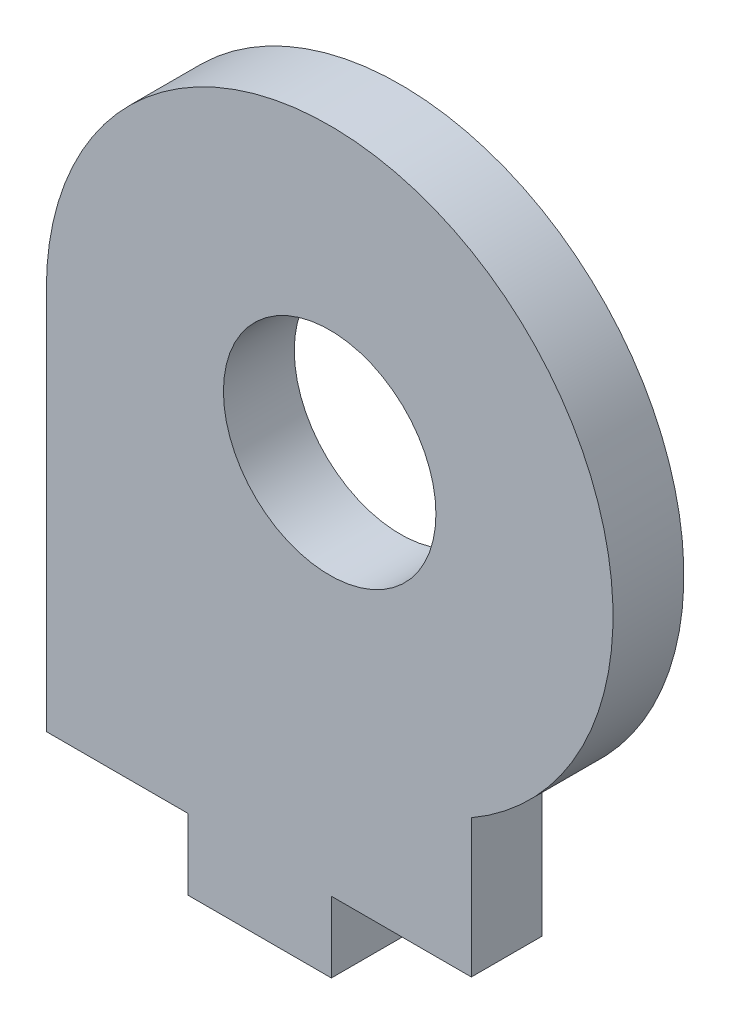
ISO-10303-21;
HEADER;
FILE_DESCRIPTION(('STEP AP214'),'2;1');
FILE_NAME('part.step','',(''),(''),'','','');
FILE_SCHEMA(('AUTOMOTIVE_DESIGN { 1 0 10303 214 1 1 1 1 }'));
ENDSEC;
DATA;
#1=APPLICATION_CONTEXT('core data for automotive mechanical design processes');
#2=APPLICATION_PROTOCOL_DEFINITION('international standard','automotive_design',2000,#1);
#3=PRODUCT_CONTEXT('',#1,'mechanical');
#4=PRODUCT('Part','Part','',(#3));
#5=PRODUCT_RELATED_PRODUCT_CATEGORY('part','',(#4));
#6=PRODUCT_DEFINITION_FORMATION('','',#4);
#7=PRODUCT_DEFINITION_CONTEXT('part definition',#1,'design');
#8=PRODUCT_DEFINITION('design','',#6,#7);
#9=PRODUCT_DEFINITION_SHAPE('','',#8);
#10=(LENGTH_UNIT() NAMED_UNIT(*) SI_UNIT(.MILLI.,.METRE.));
#11=(NAMED_UNIT(*) PLANE_ANGLE_UNIT() SI_UNIT($,.RADIAN.));
#12=(NAMED_UNIT(*) SI_UNIT($,.STERADIAN.) SOLID_ANGLE_UNIT());
#13=UNCERTAINTY_MEASURE_WITH_UNIT(LENGTH_MEASURE(1.E-05),#10,'distance_accuracy_value','');
#14=(GEOMETRIC_REPRESENTATION_CONTEXT(3) GLOBAL_UNCERTAINTY_ASSIGNED_CONTEXT((#13)) GLOBAL_UNIT_ASSIGNED_CONTEXT((#10,
#11,#12)) REPRESENTATION_CONTEXT('',''));
#15=CARTESIAN_POINT('',(0.,0.,0.));
#16=DIRECTION('',(0.,0.,1.));
#17=DIRECTION('',(1.,0.,0.));
#18=AXIS2_PLACEMENT_3D('',#15,#16,#17);
#19=CARTESIAN_POINT('',(27.0376756424581,0.,3.175));
#20=DIRECTION('',(-1.,0.,0.));
#21=DIRECTION('',(0.,0.,1.));
#22=AXIS2_PLACEMENT_3D('',#19,#20,#21);
#23=PLANE('',#22);
#24=DIRECTION('',(0.,0.,1.));
#25=VECTOR('',#24,1.);
#26=CARTESIAN_POINT('',(27.0376756424581,3.175,0.));
#27=LINE('',#26,#25);
#28=CARTESIAN_POINT('',(27.0376756424581,3.175,0.));
#29=VERTEX_POINT('',#28);
#30=CARTESIAN_POINT('',(27.0376756424581,3.175,3.175));
#31=VERTEX_POINT('',#30);
#32=EDGE_CURVE('E177',#29,#31,#27,.T.);
#33=ORIENTED_EDGE('',*,*,#32,.F.);
#34=DIRECTION('',(0.,1.,0.));
#35=VECTOR('',#34,1.);
#36=CARTESIAN_POINT('',(27.0376756424581,0.,0.));
#37=LINE('',#36,#35);
#38=CARTESIAN_POINT('',(27.0376756424581,9.35830737193762,0.));
#39=VERTEX_POINT('',#38);
#40=EDGE_CURVE('E144',#29,#39,#37,.T.);
#41=ORIENTED_EDGE('',*,*,#40,.T.);
#42=DIRECTION('',(0.,0.,-1.));
#43=VECTOR('',#42,1.);
#44=CARTESIAN_POINT('',(27.0376756424581,9.35830737193762,3.175));
#45=LINE('',#44,#43);
#46=CARTESIAN_POINT('',(27.0376756424581,9.35830737193762,3.175));
#47=VERTEX_POINT('',#46);
#48=EDGE_CURVE('E11',#47,#39,#45,.T.);
#49=ORIENTED_EDGE('',*,*,#48,.F.);
#50=DIRECTION('',(0.,1.,0.));
#51=VECTOR('',#50,1.);
#52=CARTESIAN_POINT('',(27.0376756424581,0.,3.175));
#53=LINE('',#52,#51);
#54=EDGE_CURVE('E142',#31,#47,#53,.T.);
#55=ORIENTED_EDGE('',*,*,#54,.F.);
#56=EDGE_LOOP('',(#33,#41,#49,#55));
#57=FACE_BOUND('',#56,.T.);
#58=ADVANCED_FACE('F43',(#57),#23,.F.);
#59=CARTESIAN_POINT('',(20.6876756424581,20.35683,3.175));
#60=DIRECTION('',(0.,0.,1.));
#61=DIRECTION('',(1.,0.,0.));
#62=AXIS2_PLACEMENT_3D('',#59,#60,#61);
#63=PLANE('',#62);
#64=DIRECTION('',(0.,-1.,0.));
#65=VECTOR('',#64,1.);
#66=CARTESIAN_POINT('',(14.3376756424581,3.175,3.175));
#67=LINE('',#66,#65);
#68=CARTESIAN_POINT('',(14.3376756424581,3.175,3.175));
#69=VERTEX_POINT('',#68);
#70=CARTESIAN_POINT('',(14.3376756424581,0.,3.175));
#71=VERTEX_POINT('',#70);
#72=EDGE_CURVE('E174',#69,#71,#67,.T.);
#73=ORIENTED_EDGE('',*,*,#72,.T.);
#74=DIRECTION('',(1.,0.,0.));
#75=VECTOR('',#74,1.);
#76=CARTESIAN_POINT('',(7.98767564245811,0.,3.175));
#77=LINE('',#76,#75);
#78=CARTESIAN_POINT('',(20.7638756424581,0.,3.175));
#79=VERTEX_POINT('',#78);
#80=EDGE_CURVE('E148',#71,#79,#77,.T.);
#81=ORIENTED_EDGE('',*,*,#80,.T.);
#82=DIRECTION('',(0.,-1.,0.));
#83=VECTOR('',#82,1.);
#84=CARTESIAN_POINT('',(20.7638756424581,3.175,3.175));
#85=LINE('',#84,#83);
#86=CARTESIAN_POINT('',(20.7638756424581,3.175,3.175));
#87=VERTEX_POINT('',#86);
#88=EDGE_CURVE('E58',#87,#79,#85,.T.);
#89=ORIENTED_EDGE('',*,*,#88,.F.);
#90=DIRECTION('',(-1.,0.,0.));
#91=VECTOR('',#90,1.);
#92=CARTESIAN_POINT('',(27.0376756424581,3.175,3.175));
#93=LINE('',#92,#91);
#94=EDGE_CURVE('E200',#31,#87,#93,.T.);
#95=ORIENTED_EDGE('',*,*,#94,.F.);
#96=ORIENTED_EDGE('',*,*,#54,.T.);
#97=CARTESIAN_POINT('',(20.6876756424581,20.35683,3.175));
#98=DIRECTION('',(0.,0.,1.));
#99=DIRECTION('',(1.,0.,0.));
#100=AXIS2_PLACEMENT_3D('',#97,#98,#99);
#101=CIRCLE('',#100,12.7);
#102=CARTESIAN_POINT('',(7.98767564245811,20.35683,3.175));
#103=VERTEX_POINT('',#102);
#104=EDGE_CURVE('E157',#47,#103,#101,.T.);
#105=ORIENTED_EDGE('',*,*,#104,.T.);
#106=DIRECTION('',(0.,-1.,0.));
#107=VECTOR('',#106,1.);
#108=CARTESIAN_POINT('',(7.98767564245811,20.35683,3.175));
#109=LINE('',#108,#107);
#110=CARTESIAN_POINT('',(7.98767564245811,3.175,3.175));
#111=VERTEX_POINT('',#110);
#112=EDGE_CURVE('E151',#103,#111,#109,.T.);
#113=ORIENTED_EDGE('',*,*,#112,.T.);
#114=DIRECTION('',(-1.,0.,0.));
#115=VECTOR('',#114,1.);
#116=CARTESIAN_POINT('',(7.98767564245811,3.175,3.175));
#117=LINE('',#116,#115);
#118=EDGE_CURVE('E114',#69,#111,#117,.T.);
#119=ORIENTED_EDGE('',*,*,#118,.F.);
#120=EDGE_LOOP('',(#73,#81,#89,#95,#96,#105,#113,#119));
#121=FACE_BOUND('',#120,.T.);
#122=CARTESIAN_POINT('',(20.6876756424581,20.35683,3.175));
#123=DIRECTION('',(0.,0.,1.));
#124=DIRECTION('',(1.,0.,0.));
#125=AXIS2_PLACEMENT_3D('',#122,#123,#124);
#126=CIRCLE('',#125,4.7625);
#127=CARTESIAN_POINT('',(25.4501756424581,20.35683,3.175));
#128=VERTEX_POINT('',#127);
#129=EDGE_CURVE('E161',#128,#128,#126,.T.);
#130=ORIENTED_EDGE('',*,*,#129,.F.);
#131=EDGE_LOOP('',(#130));
#132=FACE_BOUND('',#131,.T.);
#133=ADVANCED_FACE('F183',(#121,#132),#63,.T.);
#134=CARTESIAN_POINT('',(20.6876756424581,20.35683,0.));
#135=DIRECTION('',(0.,0.,1.));
#136=DIRECTION('',(1.,0.,0.));
#137=AXIS2_PLACEMENT_3D('',#134,#135,#136);
#138=PLANE('',#137);
#139=DIRECTION('',(1.,0.,0.));
#140=VECTOR('',#139,1.);
#141=CARTESIAN_POINT('',(7.98767564245811,0.,0.));
#142=LINE('',#141,#140);
#143=CARTESIAN_POINT('',(14.3376756424581,0.,0.));
#144=VERTEX_POINT('',#143);
#145=CARTESIAN_POINT('',(20.7638756424581,0.,0.));
#146=VERTEX_POINT('',#145);
#147=EDGE_CURVE('E136',#144,#146,#142,.T.);
#148=ORIENTED_EDGE('',*,*,#147,.F.);
#149=DIRECTION('',(0.,-1.,0.));
#150=VECTOR('',#149,1.);
#151=CARTESIAN_POINT('',(14.3376756424581,3.175,0.));
#152=LINE('',#151,#150);
#153=CARTESIAN_POINT('',(14.3376756424581,3.175,0.));
#154=VERTEX_POINT('',#153);
#155=EDGE_CURVE('E66',#154,#144,#152,.T.);
#156=ORIENTED_EDGE('',*,*,#155,.F.);
#157=DIRECTION('',(1.,0.,0.));
#158=VECTOR('',#157,1.);
#159=CARTESIAN_POINT('',(7.98767564245811,3.175,0.));
#160=LINE('',#159,#158);
#161=CARTESIAN_POINT('',(7.98767564245811,3.175,0.));
#162=VERTEX_POINT('',#161);
#163=EDGE_CURVE('E112',#162,#154,#160,.T.);
#164=ORIENTED_EDGE('',*,*,#163,.F.);
#165=DIRECTION('',(0.,-1.,0.));
#166=VECTOR('',#165,1.);
#167=CARTESIAN_POINT('',(7.98767564245811,20.35683,0.));
#168=LINE('',#167,#166);
#169=CARTESIAN_POINT('',(7.98767564245811,20.35683,0.));
#170=VERTEX_POINT('',#169);
#171=EDGE_CURVE('E128',#170,#162,#168,.T.);
#172=ORIENTED_EDGE('',*,*,#171,.F.);
#173=CARTESIAN_POINT('',(20.6876756424581,20.35683,0.));
#174=DIRECTION('',(0.,0.,1.));
#175=DIRECTION('',(1.,0.,0.));
#176=AXIS2_PLACEMENT_3D('',#173,#174,#175);
#177=CIRCLE('',#176,12.7);
#178=EDGE_CURVE('E137',#39,#170,#177,.T.);
#179=ORIENTED_EDGE('',*,*,#178,.F.);
#180=ORIENTED_EDGE('',*,*,#40,.F.);
#181=DIRECTION('',(1.,0.,0.));
#182=VECTOR('',#181,1.);
#183=CARTESIAN_POINT('',(27.0376756424581,3.175,0.));
#184=LINE('',#183,#182);
#185=CARTESIAN_POINT('',(20.7638756424581,3.175,0.));
#186=VERTEX_POINT('',#185);
#187=EDGE_CURVE('E191',#186,#29,#184,.T.);
#188=ORIENTED_EDGE('',*,*,#187,.F.);
#189=DIRECTION('',(0.,-1.,0.));
#190=VECTOR('',#189,1.);
#191=CARTESIAN_POINT('',(20.7638756424581,3.175,0.));
#192=LINE('',#191,#190);
#193=EDGE_CURVE('E192',#186,#146,#192,.T.);
#194=ORIENTED_EDGE('',*,*,#193,.T.);
#195=EDGE_LOOP('',(#148,#156,#164,#172,#179,#180,#188,#194));
#196=FACE_BOUND('',#195,.T.);
#197=CARTESIAN_POINT('',(20.6876756424581,20.35683,0.));
#198=DIRECTION('',(0.,0.,1.));
#199=DIRECTION('',(1.,0.,0.));
#200=AXIS2_PLACEMENT_3D('',#197,#198,#199);
#201=CIRCLE('',#200,4.7625);
#202=CARTESIAN_POINT('',(25.4501756424581,20.35683,0.));
#203=VERTEX_POINT('',#202);
#204=EDGE_CURVE('E168',#203,#203,#201,.T.);
#205=ORIENTED_EDGE('',*,*,#204,.T.);
#206=EDGE_LOOP('',(#205));
#207=FACE_BOUND('',#206,.T.);
#208=ADVANCED_FACE('F125',(#196,#207),#138,.F.);
#209=CARTESIAN_POINT('',(20.6876756424581,20.35683,3.175));
#210=DIRECTION('',(0.,0.,-1.));
#211=DIRECTION('',(-1.,0.,0.));
#212=AXIS2_PLACEMENT_3D('',#209,#210,#211);
#213=CYLINDRICAL_SURFACE('',#212,12.7);
#214=ORIENTED_EDGE('',*,*,#178,.T.);
#215=DIRECTION('',(0.,0.,-1.));
#216=VECTOR('',#215,1.);
#217=CARTESIAN_POINT('',(7.98767564245811,20.35683,3.175));
#218=LINE('',#217,#216);
#219=EDGE_CURVE('E51',#103,#170,#218,.T.);
#220=ORIENTED_EDGE('',*,*,#219,.F.);
#221=ORIENTED_EDGE('',*,*,#104,.F.);
#222=ORIENTED_EDGE('',*,*,#48,.T.);
#223=EDGE_LOOP('',(#214,#220,#221,#222));
#224=FACE_BOUND('',#223,.T.);
#225=ADVANCED_FACE('F188',(#224),#213,.T.);
#226=CARTESIAN_POINT('',(7.98767564245811,20.35683,3.175));
#227=DIRECTION('',(1.,0.,0.));
#228=DIRECTION('',(0.,1.,0.));
#229=AXIS2_PLACEMENT_3D('',#226,#227,#228);
#230=PLANE('',#229);
#231=ORIENTED_EDGE('',*,*,#171,.T.);
#232=DIRECTION('',(0.,0.,-1.));
#233=VECTOR('',#232,1.);
#234=CARTESIAN_POINT('',(7.98767564245811,3.175,0.));
#235=LINE('',#234,#233);
#236=EDGE_CURVE('E108',#111,#162,#235,.T.);
#237=ORIENTED_EDGE('',*,*,#236,.F.);
#238=ORIENTED_EDGE('',*,*,#112,.F.);
#239=ORIENTED_EDGE('',*,*,#219,.T.);
#240=EDGE_LOOP('',(#231,#237,#238,#239));
#241=FACE_BOUND('',#240,.T.);
#242=ADVANCED_FACE('F133',(#241),#230,.F.);
#243=CARTESIAN_POINT('',(7.98767564245811,0.,3.175));
#244=DIRECTION('',(0.,1.,0.));
#245=DIRECTION('',(-1.,0.,0.));
#246=AXIS2_PLACEMENT_3D('',#243,#244,#245);
#247=PLANE('',#246);
#248=ORIENTED_EDGE('',*,*,#80,.F.);
#249=DIRECTION('',(0.,0.,1.));
#250=VECTOR('',#249,1.);
#251=CARTESIAN_POINT('',(14.3376756424581,0.,0.));
#252=LINE('',#251,#250);
#253=EDGE_CURVE('E120',#144,#71,#252,.T.);
#254=ORIENTED_EDGE('',*,*,#253,.F.);
#255=ORIENTED_EDGE('',*,*,#147,.T.);
#256=DIRECTION('',(0.,0.,-1.));
#257=VECTOR('',#256,1.);
#258=CARTESIAN_POINT('',(20.7638756424581,0.,0.));
#259=LINE('',#258,#257);
#260=EDGE_CURVE('E204',#79,#146,#259,.T.);
#261=ORIENTED_EDGE('',*,*,#260,.F.);
#262=EDGE_LOOP('',(#248,#254,#255,#261));
#263=FACE_BOUND('',#262,.T.);
#264=ADVANCED_FACE('F222',(#263),#247,.F.);
#265=CARTESIAN_POINT('',(20.6876756424581,20.35683,3.175));
#266=DIRECTION('',(0.,0.,-1.));
#267=DIRECTION('',(-1.,0.,0.));
#268=AXIS2_PLACEMENT_3D('',#265,#266,#267);
#269=CYLINDRICAL_SURFACE('',#268,4.7625);
#270=ORIENTED_EDGE('',*,*,#129,.T.);
#271=EDGE_LOOP('',(#270));
#272=FACE_BOUND('',#271,.T.);
#273=ORIENTED_EDGE('',*,*,#204,.F.);
#274=EDGE_LOOP('',(#273));
#275=FACE_BOUND('',#274,.T.);
#276=ADVANCED_FACE('F224',(#272,#275),#269,.F.);
#277=CARTESIAN_POINT('',(20.7638756424581,3.175,0.));
#278=DIRECTION('',(-1.,0.,0.));
#279=DIRECTION('',(0.,-1.,0.));
#280=AXIS2_PLACEMENT_3D('',#277,#278,#279);
#281=PLANE('',#280);
#282=ORIENTED_EDGE('',*,*,#260,.T.);
#283=ORIENTED_EDGE('',*,*,#193,.F.);
#284=DIRECTION('',(0.,0.,-1.));
#285=VECTOR('',#284,1.);
#286=CARTESIAN_POINT('',(20.7638756424581,3.175,0.));
#287=LINE('',#286,#285);
#288=EDGE_CURVE('E196',#87,#186,#287,.T.);
#289=ORIENTED_EDGE('',*,*,#288,.F.);
#290=ORIENTED_EDGE('',*,*,#88,.T.);
#291=EDGE_LOOP('',(#282,#283,#289,#290));
#292=FACE_BOUND('',#291,.T.);
#293=ADVANCED_FACE('F230',(#292),#281,.F.);
#294=CARTESIAN_POINT('',(0.,3.175,0.));
#295=DIRECTION('',(0.,-1.,0.));
#296=DIRECTION('',(1.,0.,0.));
#297=AXIS2_PLACEMENT_3D('',#294,#295,#296);
#298=PLANE('',#297);
#299=ORIENTED_EDGE('',*,*,#32,.T.);
#300=ORIENTED_EDGE('',*,*,#94,.T.);
#301=ORIENTED_EDGE('',*,*,#288,.T.);
#302=ORIENTED_EDGE('',*,*,#187,.T.);
#303=EDGE_LOOP('',(#299,#300,#301,#302));
#304=FACE_BOUND('',#303,.T.);
#305=ADVANCED_FACE('F243',(#304),#298,.T.);
#306=CARTESIAN_POINT('',(14.3376756424581,3.175,0.));
#307=DIRECTION('',(1.,0.,0.));
#308=DIRECTION('',(0.,1.,0.));
#309=AXIS2_PLACEMENT_3D('',#306,#307,#308);
#310=PLANE('',#309);
#311=ORIENTED_EDGE('',*,*,#253,.T.);
#312=ORIENTED_EDGE('',*,*,#72,.F.);
#313=DIRECTION('',(0.,0.,1.));
#314=VECTOR('',#313,1.);
#315=CARTESIAN_POINT('',(14.3376756424581,3.175,0.));
#316=LINE('',#315,#314);
#317=EDGE_CURVE('E130',#154,#69,#316,.T.);
#318=ORIENTED_EDGE('',*,*,#317,.F.);
#319=ORIENTED_EDGE('',*,*,#155,.T.);
#320=EDGE_LOOP('',(#311,#312,#318,#319));
#321=FACE_BOUND('',#320,.T.);
#322=ADVANCED_FACE('F246',(#321),#310,.F.);
#323=CARTESIAN_POINT('',(0.,3.175,0.));
#324=DIRECTION('',(0.,1.,0.));
#325=DIRECTION('',(-1.,0.,0.));
#326=AXIS2_PLACEMENT_3D('',#323,#324,#325);
#327=PLANE('',#326);
#328=ORIENTED_EDGE('',*,*,#236,.T.);
#329=ORIENTED_EDGE('',*,*,#163,.T.);
#330=ORIENTED_EDGE('',*,*,#317,.T.);
#331=ORIENTED_EDGE('',*,*,#118,.T.);
#332=EDGE_LOOP('',(#328,#329,#330,#331));
#333=FACE_BOUND('',#332,.T.);
#334=ADVANCED_FACE('F110',(#333),#327,.F.);
#335=CLOSED_SHELL('',(#58,#133,#208,#225,#242,#264,#276,#293,#305,#322,#334));
#336=MANIFOLD_SOLID_BREP('B2',#335);
#337=ADVANCED_BREP_SHAPE_REPRESENTATION('',(#18,#336),#14);
#338=SHAPE_DEFINITION_REPRESENTATION(#9,#337);
ENDSEC;
END-ISO-10303-21;
